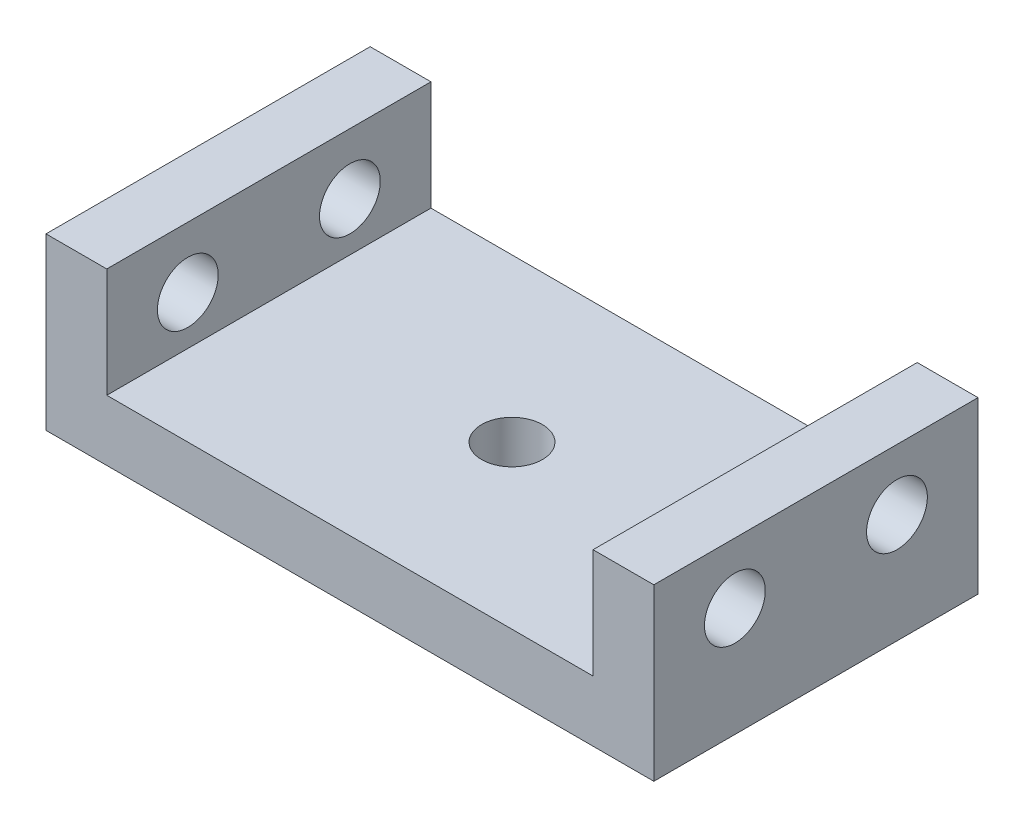
ISO-10303-21;
HEADER;
FILE_DESCRIPTION(('STEP AP214'),'2;1');
FILE_NAME('part.step','',(''),(''),'','','');
FILE_SCHEMA(('AUTOMOTIVE_DESIGN { 1 0 10303 214 1 1 1 1 }'));
ENDSEC;
DATA;
#1=APPLICATION_CONTEXT('core data for automotive mechanical design processes');
#2=APPLICATION_PROTOCOL_DEFINITION('international standard','automotive_design',2000,#1);
#3=PRODUCT_CONTEXT('',#1,'mechanical');
#4=PRODUCT('Part','Part','',(#3));
#5=PRODUCT_RELATED_PRODUCT_CATEGORY('part','',(#4));
#6=PRODUCT_DEFINITION_FORMATION('','',#4);
#7=PRODUCT_DEFINITION_CONTEXT('part definition',#1,'design');
#8=PRODUCT_DEFINITION('design','',#6,#7);
#9=PRODUCT_DEFINITION_SHAPE('','',#8);
#10=(LENGTH_UNIT() NAMED_UNIT(*) SI_UNIT(.MILLI.,.METRE.));
#11=(NAMED_UNIT(*) PLANE_ANGLE_UNIT() SI_UNIT($,.RADIAN.));
#12=(NAMED_UNIT(*) SI_UNIT($,.STERADIAN.) SOLID_ANGLE_UNIT());
#13=UNCERTAINTY_MEASURE_WITH_UNIT(LENGTH_MEASURE(1.E-05),#10,'distance_accuracy_value','');
#14=(GEOMETRIC_REPRESENTATION_CONTEXT(3) GLOBAL_UNCERTAINTY_ASSIGNED_CONTEXT((#13)) GLOBAL_UNIT_ASSIGNED_CONTEXT((#10,
#11,#12)) REPRESENTATION_CONTEXT('',''));
#15=CARTESIAN_POINT('',(0.,0.,0.));
#16=DIRECTION('',(0.,0.,1.));
#17=DIRECTION('',(1.,0.,0.));
#18=AXIS2_PLACEMENT_3D('',#15,#16,#17);
#19=CARTESIAN_POINT('',(0.,3.,0.));
#20=DIRECTION('',(0.,-1.,0.));
#21=DIRECTION('',(0.,0.,-1.));
#22=AXIS2_PLACEMENT_3D('',#19,#20,#21);
#23=PLANE('',#22);
#24=CARTESIAN_POINT('',(0.,3.,0.));
#25=DIRECTION('',(0.,1.,0.));
#26=DIRECTION('',(0.,0.,1.));
#27=AXIS2_PLACEMENT_3D('',#24,#25,#26);
#28=CIRCLE('',#27,1.5);
#29=CARTESIAN_POINT('',(0.,3.,1.5));
#30=VERTEX_POINT('',#29);
#31=EDGE_CURVE('E200',#30,#30,#28,.T.);
#32=ORIENTED_EDGE('',*,*,#31,.F.);
#33=EDGE_LOOP('',(#32));
#34=FACE_BOUND('',#33,.T.);
#35=DIRECTION('',(1.,0.,0.));
#36=VECTOR('',#35,1.);
#37=CARTESIAN_POINT('',(-15.,3.,8.));
#38=LINE('',#37,#36);
#39=CARTESIAN_POINT('',(-12.,3.,8.));
#40=VERTEX_POINT('',#39);
#41=CARTESIAN_POINT('',(12.,3.,8.));
#42=VERTEX_POINT('',#41);
#43=EDGE_CURVE('E55',#40,#42,#38,.T.);
#44=ORIENTED_EDGE('',*,*,#43,.T.);
#45=DIRECTION('',(0.,0.,-1.));
#46=VECTOR('',#45,1.);
#47=CARTESIAN_POINT('',(12.,3.,-8.));
#48=LINE('',#47,#46);
#49=CARTESIAN_POINT('',(12.,3.,-8.));
#50=VERTEX_POINT('',#49);
#51=EDGE_CURVE('E50',#42,#50,#48,.T.);
#52=ORIENTED_EDGE('',*,*,#51,.T.);
#53=DIRECTION('',(-1.,0.,0.));
#54=VECTOR('',#53,1.);
#55=CARTESIAN_POINT('',(-15.,3.,-8.));
#56=LINE('',#55,#54);
#57=CARTESIAN_POINT('',(-12.,3.,-8.));
#58=VERTEX_POINT('',#57);
#59=EDGE_CURVE('E157',#50,#58,#56,.T.);
#60=ORIENTED_EDGE('',*,*,#59,.T.);
#61=DIRECTION('',(0.,0.,-1.));
#62=VECTOR('',#61,1.);
#63=CARTESIAN_POINT('',(-12.,3.,-8.));
#64=LINE('',#63,#62);
#65=EDGE_CURVE('E141',#40,#58,#64,.T.);
#66=ORIENTED_EDGE('',*,*,#65,.F.);
#67=EDGE_LOOP('',(#44,#52,#60,#66));
#68=FACE_BOUND('',#67,.T.);
#69=ADVANCED_FACE('F33',(#34,#68),#23,.F.);
#70=CARTESIAN_POINT('',(15.,3.,8.));
#71=DIRECTION('',(-1.,0.,0.));
#72=DIRECTION('',(0.,0.,1.));
#73=AXIS2_PLACEMENT_3D('',#70,#71,#72);
#74=PLANE('',#73);
#75=CARTESIAN_POINT('',(15.,5.4,-4.));
#76=DIRECTION('',(-1.,0.,0.));
#77=DIRECTION('',(0.,0.,1.));
#78=AXIS2_PLACEMENT_3D('',#75,#76,#77);
#79=CIRCLE('',#78,1.5);
#80=CARTESIAN_POINT('',(15.,5.4,-2.5));
#81=VERTEX_POINT('',#80);
#82=EDGE_CURVE('E180',#81,#81,#79,.T.);
#83=ORIENTED_EDGE('',*,*,#82,.T.);
#84=EDGE_LOOP('',(#83));
#85=FACE_BOUND('',#84,.T.);
#86=CARTESIAN_POINT('',(15.,5.4,4.));
#87=DIRECTION('',(-1.,0.,0.));
#88=DIRECTION('',(0.,0.,1.));
#89=AXIS2_PLACEMENT_3D('',#86,#87,#88);
#90=CIRCLE('',#89,1.5);
#91=CARTESIAN_POINT('',(15.,5.4,5.5));
#92=VERTEX_POINT('',#91);
#93=EDGE_CURVE('E196',#92,#92,#90,.T.);
#94=ORIENTED_EDGE('',*,*,#93,.T.);
#95=EDGE_LOOP('',(#94));
#96=FACE_BOUND('',#95,.T.);
#97=DIRECTION('',(0.,0.,-1.));
#98=VECTOR('',#97,1.);
#99=CARTESIAN_POINT('',(15.,0.,8.));
#100=LINE('',#99,#98);
#101=CARTESIAN_POINT('',(15.,0.,8.));
#102=VERTEX_POINT('',#101);
#103=CARTESIAN_POINT('',(15.,0.,-8.));
#104=VERTEX_POINT('',#103);
#105=EDGE_CURVE('E104',#102,#104,#100,.T.);
#106=ORIENTED_EDGE('',*,*,#105,.T.);
#107=DIRECTION('',(0.,-1.,0.));
#108=VECTOR('',#107,1.);
#109=CARTESIAN_POINT('',(15.,3.,-8.));
#110=LINE('',#109,#108);
#111=CARTESIAN_POINT('',(15.,8.4,-8.));
#112=VERTEX_POINT('',#111);
#113=EDGE_CURVE('E11',#112,#104,#110,.T.);
#114=ORIENTED_EDGE('',*,*,#113,.F.);
#115=DIRECTION('',(0.,0.,1.));
#116=VECTOR('',#115,1.);
#117=CARTESIAN_POINT('',(15.,8.4,-8.));
#118=LINE('',#117,#116);
#119=CARTESIAN_POINT('',(15.,8.4,8.));
#120=VERTEX_POINT('',#119);
#121=EDGE_CURVE('E101',#112,#120,#118,.T.);
#122=ORIENTED_EDGE('',*,*,#121,.T.);
#123=DIRECTION('',(0.,-1.,0.));
#124=VECTOR('',#123,1.);
#125=CARTESIAN_POINT('',(15.,3.,8.));
#126=LINE('',#125,#124);
#127=EDGE_CURVE('E161',#120,#102,#126,.T.);
#128=ORIENTED_EDGE('',*,*,#127,.T.);
#129=EDGE_LOOP('',(#106,#114,#122,#128));
#130=FACE_BOUND('',#129,.T.);
#131=ADVANCED_FACE('F35',(#85,#96,#130),#74,.F.);
#132=CARTESIAN_POINT('',(-15.,3.,-8.));
#133=DIRECTION('',(0.,0.,1.));
#134=DIRECTION('',(1.,0.,0.));
#135=AXIS2_PLACEMENT_3D('',#132,#133,#134);
#136=PLANE('',#135);
#137=DIRECTION('',(-1.,0.,0.));
#138=VECTOR('',#137,1.);
#139=CARTESIAN_POINT('',(-15.,0.,-8.));
#140=LINE('',#139,#138);
#141=CARTESIAN_POINT('',(-15.,0.,-8.));
#142=VERTEX_POINT('',#141);
#143=EDGE_CURVE('E163',#104,#142,#140,.T.);
#144=ORIENTED_EDGE('',*,*,#143,.T.);
#145=DIRECTION('',(0.,-1.,0.));
#146=VECTOR('',#145,1.);
#147=CARTESIAN_POINT('',(-15.,3.,-8.));
#148=LINE('',#147,#146);
#149=CARTESIAN_POINT('',(-15.,8.4,-8.));
#150=VERTEX_POINT('',#149);
#151=EDGE_CURVE('E42',#150,#142,#148,.T.);
#152=ORIENTED_EDGE('',*,*,#151,.F.);
#153=DIRECTION('',(-1.,0.,0.));
#154=VECTOR('',#153,1.);
#155=CARTESIAN_POINT('',(-15.,8.4,-8.));
#156=LINE('',#155,#154);
#157=CARTESIAN_POINT('',(-12.,8.4,-8.));
#158=VERTEX_POINT('',#157);
#159=EDGE_CURVE('E145',#158,#150,#156,.T.);
#160=ORIENTED_EDGE('',*,*,#159,.F.);
#161=DIRECTION('',(0.,-1.,0.));
#162=VECTOR('',#161,1.);
#163=CARTESIAN_POINT('',(-12.,8.4,-8.));
#164=LINE('',#163,#162);
#165=EDGE_CURVE('E148',#158,#58,#164,.T.);
#166=ORIENTED_EDGE('',*,*,#165,.T.);
#167=ORIENTED_EDGE('',*,*,#59,.F.);
#168=DIRECTION('',(0.,-1.,0.));
#169=VECTOR('',#168,1.);
#170=CARTESIAN_POINT('',(12.,8.4,-8.));
#171=LINE('',#170,#169);
#172=CARTESIAN_POINT('',(12.,8.4,-8.));
#173=VERTEX_POINT('',#172);
#174=EDGE_CURVE('E118',#173,#50,#171,.T.);
#175=ORIENTED_EDGE('',*,*,#174,.F.);
#176=DIRECTION('',(1.,0.,0.));
#177=VECTOR('',#176,1.);
#178=CARTESIAN_POINT('',(15.,8.4,-8.));
#179=LINE('',#178,#177);
#180=EDGE_CURVE('E111',#173,#112,#179,.T.);
#181=ORIENTED_EDGE('',*,*,#180,.T.);
#182=ORIENTED_EDGE('',*,*,#113,.T.);
#183=EDGE_LOOP('',(#144,#152,#160,#166,#167,#175,#181,#182));
#184=FACE_BOUND('',#183,.T.);
#185=ADVANCED_FACE('F116',(#184),#136,.F.);
#186=CARTESIAN_POINT('',(-15.,3.,8.));
#187=DIRECTION('',(1.,0.,0.));
#188=DIRECTION('',(0.,0.,-1.));
#189=AXIS2_PLACEMENT_3D('',#186,#187,#188);
#190=PLANE('',#189);
#191=CARTESIAN_POINT('',(-15.,5.4,-4.));
#192=DIRECTION('',(-1.,0.,0.));
#193=DIRECTION('',(0.,0.,1.));
#194=AXIS2_PLACEMENT_3D('',#191,#192,#193);
#195=CIRCLE('',#194,1.5);
#196=CARTESIAN_POINT('',(-15.,5.4,-2.5));
#197=VERTEX_POINT('',#196);
#198=EDGE_CURVE('E131',#197,#197,#195,.T.);
#199=ORIENTED_EDGE('',*,*,#198,.F.);
#200=EDGE_LOOP('',(#199));
#201=FACE_BOUND('',#200,.T.);
#202=CARTESIAN_POINT('',(-15.,5.4,4.));
#203=DIRECTION('',(-1.,0.,0.));
#204=DIRECTION('',(0.,0.,1.));
#205=AXIS2_PLACEMENT_3D('',#202,#203,#204);
#206=CIRCLE('',#205,1.5);
#207=CARTESIAN_POINT('',(-15.,5.4,5.5));
#208=VERTEX_POINT('',#207);
#209=EDGE_CURVE('E130',#208,#208,#206,.T.);
#210=ORIENTED_EDGE('',*,*,#209,.F.);
#211=EDGE_LOOP('',(#210));
#212=FACE_BOUND('',#211,.T.);
#213=DIRECTION('',(0.,0.,1.));
#214=VECTOR('',#213,1.);
#215=CARTESIAN_POINT('',(-15.,0.,8.));
#216=LINE('',#215,#214);
#217=CARTESIAN_POINT('',(-15.,0.,8.));
#218=VERTEX_POINT('',#217);
#219=EDGE_CURVE('E165',#142,#218,#216,.T.);
#220=ORIENTED_EDGE('',*,*,#219,.T.);
#221=DIRECTION('',(0.,-1.,0.));
#222=VECTOR('',#221,1.);
#223=CARTESIAN_POINT('',(-15.,3.,8.));
#224=LINE('',#223,#222);
#225=CARTESIAN_POINT('',(-15.,8.4,8.));
#226=VERTEX_POINT('',#225);
#227=EDGE_CURVE('E169',#226,#218,#224,.T.);
#228=ORIENTED_EDGE('',*,*,#227,.F.);
#229=DIRECTION('',(0.,0.,1.));
#230=VECTOR('',#229,1.);
#231=CARTESIAN_POINT('',(-15.,8.4,-8.));
#232=LINE('',#231,#230);
#233=EDGE_CURVE('E137',#150,#226,#232,.T.);
#234=ORIENTED_EDGE('',*,*,#233,.F.);
#235=ORIENTED_EDGE('',*,*,#151,.T.);
#236=EDGE_LOOP('',(#220,#228,#234,#235));
#237=FACE_BOUND('',#236,.T.);
#238=ADVANCED_FACE('F219',(#201,#212,#237),#190,.F.);
#239=CARTESIAN_POINT('',(-15.,3.,8.));
#240=DIRECTION('',(0.,0.,-1.));
#241=DIRECTION('',(-1.,0.,0.));
#242=AXIS2_PLACEMENT_3D('',#239,#240,#241);
#243=PLANE('',#242);
#244=DIRECTION('',(1.,0.,0.));
#245=VECTOR('',#244,1.);
#246=CARTESIAN_POINT('',(-15.,0.,8.));
#247=LINE('',#246,#245);
#248=EDGE_CURVE('E159',#218,#102,#247,.T.);
#249=ORIENTED_EDGE('',*,*,#248,.T.);
#250=ORIENTED_EDGE('',*,*,#127,.F.);
#251=DIRECTION('',(-1.,0.,0.));
#252=VECTOR('',#251,1.);
#253=CARTESIAN_POINT('',(15.,8.4,8.));
#254=LINE('',#253,#252);
#255=CARTESIAN_POINT('',(12.,8.4,8.));
#256=VERTEX_POINT('',#255);
#257=EDGE_CURVE('E114',#120,#256,#254,.T.);
#258=ORIENTED_EDGE('',*,*,#257,.T.);
#259=DIRECTION('',(0.,-1.,0.));
#260=VECTOR('',#259,1.);
#261=CARTESIAN_POINT('',(12.,8.4,8.));
#262=LINE('',#261,#260);
#263=EDGE_CURVE('E125',#256,#42,#262,.T.);
#264=ORIENTED_EDGE('',*,*,#263,.T.);
#265=ORIENTED_EDGE('',*,*,#43,.F.);
#266=DIRECTION('',(0.,-1.,0.));
#267=VECTOR('',#266,1.);
#268=CARTESIAN_POINT('',(-12.,8.4,8.));
#269=LINE('',#268,#267);
#270=CARTESIAN_POINT('',(-12.,8.4,8.));
#271=VERTEX_POINT('',#270);
#272=EDGE_CURVE('E154',#271,#40,#269,.T.);
#273=ORIENTED_EDGE('',*,*,#272,.F.);
#274=DIRECTION('',(1.,0.,0.));
#275=VECTOR('',#274,1.);
#276=CARTESIAN_POINT('',(-15.,8.4,8.));
#277=LINE('',#276,#275);
#278=EDGE_CURVE('E140',#226,#271,#277,.T.);
#279=ORIENTED_EDGE('',*,*,#278,.F.);
#280=ORIENTED_EDGE('',*,*,#227,.T.);
#281=EDGE_LOOP('',(#249,#250,#258,#264,#265,#273,#279,#280));
#282=FACE_BOUND('',#281,.T.);
#283=ADVANCED_FACE('F212',(#282),#243,.F.);
#284=CARTESIAN_POINT('',(0.,0.,0.));
#285=DIRECTION('',(0.,-1.,0.));
#286=DIRECTION('',(0.,0.,-1.));
#287=AXIS2_PLACEMENT_3D('',#284,#285,#286);
#288=PLANE('',#287);
#289=CARTESIAN_POINT('',(0.,0.,0.));
#290=DIRECTION('',(0.,-1.,0.));
#291=DIRECTION('',(0.,0.,-1.));
#292=AXIS2_PLACEMENT_3D('',#289,#290,#291);
#293=CIRCLE('',#292,1.5);
#294=CARTESIAN_POINT('',(0.,0.,-1.5));
#295=VERTEX_POINT('',#294);
#296=EDGE_CURVE('E37',#295,#295,#293,.T.);
#297=ORIENTED_EDGE('',*,*,#296,.F.);
#298=EDGE_LOOP('',(#297));
#299=FACE_BOUND('',#298,.T.);
#300=ORIENTED_EDGE('',*,*,#105,.F.);
#301=ORIENTED_EDGE('',*,*,#248,.F.);
#302=ORIENTED_EDGE('',*,*,#219,.F.);
#303=ORIENTED_EDGE('',*,*,#143,.F.);
#304=EDGE_LOOP('',(#300,#301,#302,#303));
#305=FACE_BOUND('',#304,.T.);
#306=ADVANCED_FACE('F208',(#299,#305),#288,.T.);
#307=CARTESIAN_POINT('',(-12.,8.4,-8.));
#308=DIRECTION('',(-1.,0.,0.));
#309=DIRECTION('',(0.,0.,1.));
#310=AXIS2_PLACEMENT_3D('',#307,#308,#309);
#311=PLANE('',#310);
#312=CARTESIAN_POINT('',(-12.,5.4,-4.));
#313=DIRECTION('',(-1.,0.,0.));
#314=DIRECTION('',(0.,0.,1.));
#315=AXIS2_PLACEMENT_3D('',#312,#313,#314);
#316=CIRCLE('',#315,1.5);
#317=CARTESIAN_POINT('',(-12.,5.4,-2.5));
#318=VERTEX_POINT('',#317);
#319=EDGE_CURVE('E151',#318,#318,#316,.T.);
#320=ORIENTED_EDGE('',*,*,#319,.T.);
#321=EDGE_LOOP('',(#320));
#322=FACE_BOUND('',#321,.T.);
#323=CARTESIAN_POINT('',(-12.,5.4,4.));
#324=DIRECTION('',(-1.,0.,0.));
#325=DIRECTION('',(0.,0.,1.));
#326=AXIS2_PLACEMENT_3D('',#323,#324,#325);
#327=CIRCLE('',#326,1.5);
#328=CARTESIAN_POINT('',(-12.,5.4,5.5));
#329=VERTEX_POINT('',#328);
#330=EDGE_CURVE('E134',#329,#329,#327,.T.);
#331=ORIENTED_EDGE('',*,*,#330,.T.);
#332=EDGE_LOOP('',(#331));
#333=FACE_BOUND('',#332,.T.);
#334=ORIENTED_EDGE('',*,*,#65,.T.);
#335=ORIENTED_EDGE('',*,*,#165,.F.);
#336=DIRECTION('',(0.,0.,-1.));
#337=VECTOR('',#336,1.);
#338=CARTESIAN_POINT('',(-12.,8.4,-8.));
#339=LINE('',#338,#337);
#340=EDGE_CURVE('E143',#271,#158,#339,.T.);
#341=ORIENTED_EDGE('',*,*,#340,.F.);
#342=ORIENTED_EDGE('',*,*,#272,.T.);
#343=EDGE_LOOP('',(#334,#335,#341,#342));
#344=FACE_BOUND('',#343,.T.);
#345=ADVANCED_FACE('F211',(#322,#333,#344),#311,.F.);
#346=CARTESIAN_POINT('',(0.,8.4,0.));
#347=DIRECTION('',(0.,1.,0.));
#348=DIRECTION('',(0.,0.,1.));
#349=AXIS2_PLACEMENT_3D('',#346,#347,#348);
#350=PLANE('',#349);
#351=ORIENTED_EDGE('',*,*,#233,.T.);
#352=ORIENTED_EDGE('',*,*,#278,.T.);
#353=ORIENTED_EDGE('',*,*,#340,.T.);
#354=ORIENTED_EDGE('',*,*,#159,.T.);
#355=EDGE_LOOP('',(#351,#352,#353,#354));
#356=FACE_BOUND('',#355,.T.);
#357=ADVANCED_FACE('F222',(#356),#350,.T.);
#358=CARTESIAN_POINT('',(-9.59999999999999,5.4,4.));
#359=DIRECTION('',(-1.,0.,0.));
#360=DIRECTION('',(0.,0.,1.));
#361=AXIS2_PLACEMENT_3D('',#358,#359,#360);
#362=CYLINDRICAL_SURFACE('',#361,1.5);
#363=ORIENTED_EDGE('',*,*,#209,.T.);
#364=EDGE_LOOP('',(#363));
#365=FACE_BOUND('',#364,.T.);
#366=ORIENTED_EDGE('',*,*,#330,.F.);
#367=EDGE_LOOP('',(#366));
#368=FACE_BOUND('',#367,.T.);
#369=ADVANCED_FACE('F237',(#365,#368),#362,.F.);
#370=CARTESIAN_POINT('',(-9.59999999999999,5.4,-4.));
#371=DIRECTION('',(-1.,0.,0.));
#372=DIRECTION('',(0.,0.,1.));
#373=AXIS2_PLACEMENT_3D('',#370,#371,#372);
#374=CYLINDRICAL_SURFACE('',#373,1.5);
#375=ORIENTED_EDGE('',*,*,#198,.T.);
#376=EDGE_LOOP('',(#375));
#377=FACE_BOUND('',#376,.T.);
#378=ORIENTED_EDGE('',*,*,#319,.F.);
#379=EDGE_LOOP('',(#378));
#380=FACE_BOUND('',#379,.T.);
#381=ADVANCED_FACE('F230',(#377,#380),#374,.F.);
#382=CARTESIAN_POINT('',(12.,8.4,-8.));
#383=DIRECTION('',(-1.,0.,0.));
#384=DIRECTION('',(0.,0.,1.));
#385=AXIS2_PLACEMENT_3D('',#382,#383,#384);
#386=PLANE('',#385);
#387=CARTESIAN_POINT('',(12.,5.4,-4.));
#388=DIRECTION('',(-1.,0.,0.));
#389=DIRECTION('',(0.,0.,1.));
#390=AXIS2_PLACEMENT_3D('',#387,#388,#389);
#391=CIRCLE('',#390,1.5);
#392=CARTESIAN_POINT('',(12.,5.4,-2.5));
#393=VERTEX_POINT('',#392);
#394=EDGE_CURVE('E127',#393,#393,#391,.F.);
#395=ORIENTED_EDGE('',*,*,#394,.T.);
#396=EDGE_LOOP('',(#395));
#397=FACE_BOUND('',#396,.T.);
#398=CARTESIAN_POINT('',(12.,5.4,4.));
#399=DIRECTION('',(-1.,0.,0.));
#400=DIRECTION('',(0.,0.,1.));
#401=AXIS2_PLACEMENT_3D('',#398,#399,#400);
#402=CIRCLE('',#401,1.5);
#403=CARTESIAN_POINT('',(12.,5.4,5.5));
#404=VERTEX_POINT('',#403);
#405=EDGE_CURVE('E178',#404,#404,#402,.F.);
#406=ORIENTED_EDGE('',*,*,#405,.T.);
#407=EDGE_LOOP('',(#406));
#408=FACE_BOUND('',#407,.T.);
#409=ORIENTED_EDGE('',*,*,#51,.F.);
#410=ORIENTED_EDGE('',*,*,#263,.F.);
#411=DIRECTION('',(0.,0.,-1.));
#412=VECTOR('',#411,1.);
#413=CARTESIAN_POINT('',(12.,8.4,-8.));
#414=LINE('',#413,#412);
#415=EDGE_CURVE('E119',#256,#173,#414,.T.);
#416=ORIENTED_EDGE('',*,*,#415,.T.);
#417=ORIENTED_EDGE('',*,*,#174,.T.);
#418=EDGE_LOOP('',(#409,#410,#416,#417));
#419=FACE_BOUND('',#418,.T.);
#420=ADVANCED_FACE('F184',(#397,#408,#419),#386,.T.);
#421=CARTESIAN_POINT('',(0.,8.4,0.));
#422=DIRECTION('',(0.,1.,0.));
#423=DIRECTION('',(0.,0.,1.));
#424=AXIS2_PLACEMENT_3D('',#421,#422,#423);
#425=PLANE('',#424);
#426=ORIENTED_EDGE('',*,*,#121,.F.);
#427=ORIENTED_EDGE('',*,*,#180,.F.);
#428=ORIENTED_EDGE('',*,*,#415,.F.);
#429=ORIENTED_EDGE('',*,*,#257,.F.);
#430=EDGE_LOOP('',(#426,#427,#428,#429));
#431=FACE_BOUND('',#430,.T.);
#432=ADVANCED_FACE('F109',(#431),#425,.T.);
#433=CARTESIAN_POINT('',(9.59999999999999,5.4,4.));
#434=DIRECTION('',(1.,0.,0.));
#435=DIRECTION('',(0.,0.,-1.));
#436=AXIS2_PLACEMENT_3D('',#433,#434,#435);
#437=CYLINDRICAL_SURFACE('',#436,1.5);
#438=ORIENTED_EDGE('',*,*,#405,.F.);
#439=EDGE_LOOP('',(#438));
#440=FACE_BOUND('',#439,.T.);
#441=ORIENTED_EDGE('',*,*,#93,.F.);
#442=EDGE_LOOP('',(#441));
#443=FACE_BOUND('',#442,.T.);
#444=ADVANCED_FACE('F191',(#440,#443),#437,.F.);
#445=CARTESIAN_POINT('',(9.59999999999999,5.4,-4.));
#446=DIRECTION('',(1.,0.,0.));
#447=DIRECTION('',(0.,0.,-1.));
#448=AXIS2_PLACEMENT_3D('',#445,#446,#447);
#449=CYLINDRICAL_SURFACE('',#448,1.5);
#450=ORIENTED_EDGE('',*,*,#394,.F.);
#451=EDGE_LOOP('',(#450));
#452=FACE_BOUND('',#451,.T.);
#453=ORIENTED_EDGE('',*,*,#82,.F.);
#454=EDGE_LOOP('',(#453));
#455=FACE_BOUND('',#454,.T.);
#456=ADVANCED_FACE('F187',(#452,#455),#449,.F.);
#457=CARTESIAN_POINT('',(0.,-7.,0.));
#458=DIRECTION('',(0.,1.,0.));
#459=DIRECTION('',(0.,0.,1.));
#460=AXIS2_PLACEMENT_3D('',#457,#458,#459);
#461=CYLINDRICAL_SURFACE('',#460,1.5);
#462=ORIENTED_EDGE('',*,*,#296,.T.);
#463=EDGE_LOOP('',(#462));
#464=FACE_BOUND('',#463,.T.);
#465=ORIENTED_EDGE('',*,*,#31,.T.);
#466=EDGE_LOOP('',(#465));
#467=FACE_BOUND('',#466,.T.);
#468=ADVANCED_FACE('F190',(#464,#467),#461,.F.);
#469=CLOSED_SHELL('',(#69,#131,#185,#238,#283,#306,#345,#357,#369,#381,#420,#432,#444,#456,#468));
#470=MANIFOLD_SOLID_BREP('B2',#469);
#471=ADVANCED_BREP_SHAPE_REPRESENTATION('',(#18,#470),#14);
#472=SHAPE_DEFINITION_REPRESENTATION(#9,#471);
ENDSEC;
END-ISO-10303-21;
